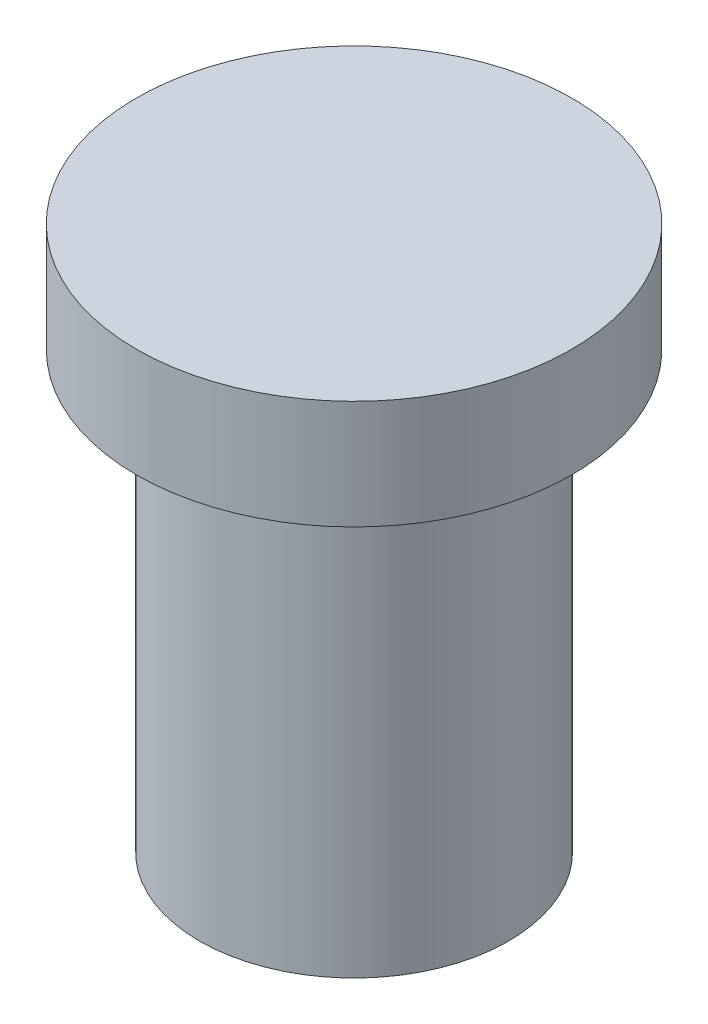
ISO-10303-21;
HEADER;
FILE_DESCRIPTION(('STEP AP214'),'2;1');
FILE_NAME('part.step','',(''),(''),'','','');
FILE_SCHEMA(('AUTOMOTIVE_DESIGN { 1 0 10303 214 1 1 1 1 }'));
ENDSEC;
DATA;
#1=APPLICATION_CONTEXT('core data for automotive mechanical design processes');
#2=APPLICATION_PROTOCOL_DEFINITION('international standard','automotive_design',2000,#1);
#3=PRODUCT_CONTEXT('',#1,'mechanical');
#4=PRODUCT('Part','Part','',(#3));
#5=PRODUCT_RELATED_PRODUCT_CATEGORY('part','',(#4));
#6=PRODUCT_DEFINITION_FORMATION('','',#4);
#7=PRODUCT_DEFINITION_CONTEXT('part definition',#1,'design');
#8=PRODUCT_DEFINITION('design','',#6,#7);
#9=PRODUCT_DEFINITION_SHAPE('','',#8);
#10=(LENGTH_UNIT() NAMED_UNIT(*) SI_UNIT(.MILLI.,.METRE.));
#11=(NAMED_UNIT(*) PLANE_ANGLE_UNIT() SI_UNIT($,.RADIAN.));
#12=(NAMED_UNIT(*) SI_UNIT($,.STERADIAN.) SOLID_ANGLE_UNIT());
#13=UNCERTAINTY_MEASURE_WITH_UNIT(LENGTH_MEASURE(1.E-05),#10,'distance_accuracy_value','');
#14=(GEOMETRIC_REPRESENTATION_CONTEXT(3) GLOBAL_UNCERTAINTY_ASSIGNED_CONTEXT((#13)) GLOBAL_UNIT_ASSIGNED_CONTEXT((#10,
#11,#12)) REPRESENTATION_CONTEXT('',''));
#15=CARTESIAN_POINT('',(0.,0.,0.));
#16=DIRECTION('',(0.,0.,1.));
#17=DIRECTION('',(1.,0.,0.));
#18=AXIS2_PLACEMENT_3D('',#15,#16,#17);
#19=CARTESIAN_POINT('',(0.,10.,0.));
#20=DIRECTION('',(0.,-1.,0.));
#21=DIRECTION('',(0.,0.,-1.));
#22=AXIS2_PLACEMENT_3D('',#19,#20,#21);
#23=CYLINDRICAL_SURFACE('',#22,3.55);
#24=CARTESIAN_POINT('',(0.,10.,0.));
#25=DIRECTION('',(0.,1.,0.));
#26=DIRECTION('',(0.,0.,1.));
#27=AXIS2_PLACEMENT_3D('',#24,#25,#26);
#28=CIRCLE('',#27,3.55);
#29=CARTESIAN_POINT('',(0.,10.,3.55));
#30=VERTEX_POINT('',#29);
#31=EDGE_CURVE('E10',#30,#30,#28,.T.);
#32=ORIENTED_EDGE('',*,*,#31,.F.);
#33=EDGE_LOOP('',(#32));
#34=FACE_BOUND('',#33,.T.);
#35=CARTESIAN_POINT('',(0.,0.,0.));
#36=DIRECTION('',(0.,1.,0.));
#37=DIRECTION('',(0.,0.,1.));
#38=AXIS2_PLACEMENT_3D('',#35,#36,#37);
#39=CIRCLE('',#38,3.55);
#40=CARTESIAN_POINT('',(0.,0.,3.55));
#41=VERTEX_POINT('',#40);
#42=EDGE_CURVE('E34',#41,#41,#39,.T.);
#43=ORIENTED_EDGE('',*,*,#42,.T.);
#44=EDGE_LOOP('',(#43));
#45=FACE_BOUND('',#44,.T.);
#46=ADVANCED_FACE('F31',(#34,#45),#23,.T.);
#47=CARTESIAN_POINT('',(0.,0.,0.));
#48=DIRECTION('',(0.,1.,0.));
#49=DIRECTION('',(0.,0.,1.));
#50=AXIS2_PLACEMENT_3D('',#47,#48,#49);
#51=PLANE('',#50);
#52=ORIENTED_EDGE('',*,*,#42,.F.);
#53=EDGE_LOOP('',(#52));
#54=FACE_BOUND('',#53,.T.);
#55=ADVANCED_FACE('F54',(#54),#51,.F.);
#56=CARTESIAN_POINT('',(0.,12.5,0.));
#57=DIRECTION('',(0.,-1.,0.));
#58=DIRECTION('',(0.,0.,-1.));
#59=AXIS2_PLACEMENT_3D('',#56,#57,#58);
#60=CYLINDRICAL_SURFACE('',#59,5.);
#61=CARTESIAN_POINT('',(0.,12.5,0.));
#62=DIRECTION('',(0.,1.,0.));
#63=DIRECTION('',(0.,0.,1.));
#64=AXIS2_PLACEMENT_3D('',#61,#62,#63);
#65=CIRCLE('',#64,5.);
#66=CARTESIAN_POINT('',(0.,12.5,5.));
#67=VERTEX_POINT('',#66);
#68=EDGE_CURVE('E41',#67,#67,#65,.T.);
#69=ORIENTED_EDGE('',*,*,#68,.F.);
#70=EDGE_LOOP('',(#69));
#71=FACE_BOUND('',#70,.T.);
#72=CARTESIAN_POINT('',(0.,10.,0.));
#73=DIRECTION('',(0.,1.,0.));
#74=DIRECTION('',(0.,0.,1.));
#75=AXIS2_PLACEMENT_3D('',#72,#73,#74);
#76=CIRCLE('',#75,5.);
#77=CARTESIAN_POINT('',(0.,10.,5.));
#78=VERTEX_POINT('',#77);
#79=EDGE_CURVE('E43',#78,#78,#76,.T.);
#80=ORIENTED_EDGE('',*,*,#79,.T.);
#81=EDGE_LOOP('',(#80));
#82=FACE_BOUND('',#81,.T.);
#83=ADVANCED_FACE('F51',(#71,#82),#60,.T.);
#84=CARTESIAN_POINT('',(0.,12.5,0.));
#85=DIRECTION('',(0.,1.,0.));
#86=DIRECTION('',(0.,0.,1.));
#87=AXIS2_PLACEMENT_3D('',#84,#85,#86);
#88=PLANE('',#87);
#89=ORIENTED_EDGE('',*,*,#68,.T.);
#90=EDGE_LOOP('',(#89));
#91=FACE_BOUND('',#90,.T.);
#92=ADVANCED_FACE('F49',(#91),#88,.T.);
#93=CARTESIAN_POINT('',(0.,10.,0.));
#94=DIRECTION('',(0.,1.,0.));
#95=DIRECTION('',(0.,0.,1.));
#96=AXIS2_PLACEMENT_3D('',#93,#94,#95);
#97=PLANE('',#96);
#98=ORIENTED_EDGE('',*,*,#31,.T.);
#99=EDGE_LOOP('',(#98));
#100=FACE_BOUND('',#99,.T.);
#101=ORIENTED_EDGE('',*,*,#79,.F.);
#102=EDGE_LOOP('',(#101));
#103=FACE_BOUND('',#102,.T.);
#104=ADVANCED_FACE('F58',(#100,#103),#97,.F.);
#105=CLOSED_SHELL('',(#46,#55,#83,#92,#104));
#106=MANIFOLD_SOLID_BREP('B2',#105);
#107=ADVANCED_BREP_SHAPE_REPRESENTATION('',(#18,#106),#14);
#108=SHAPE_DEFINITION_REPRESENTATION(#9,#107);
ENDSEC;
END-ISO-10303-21;
